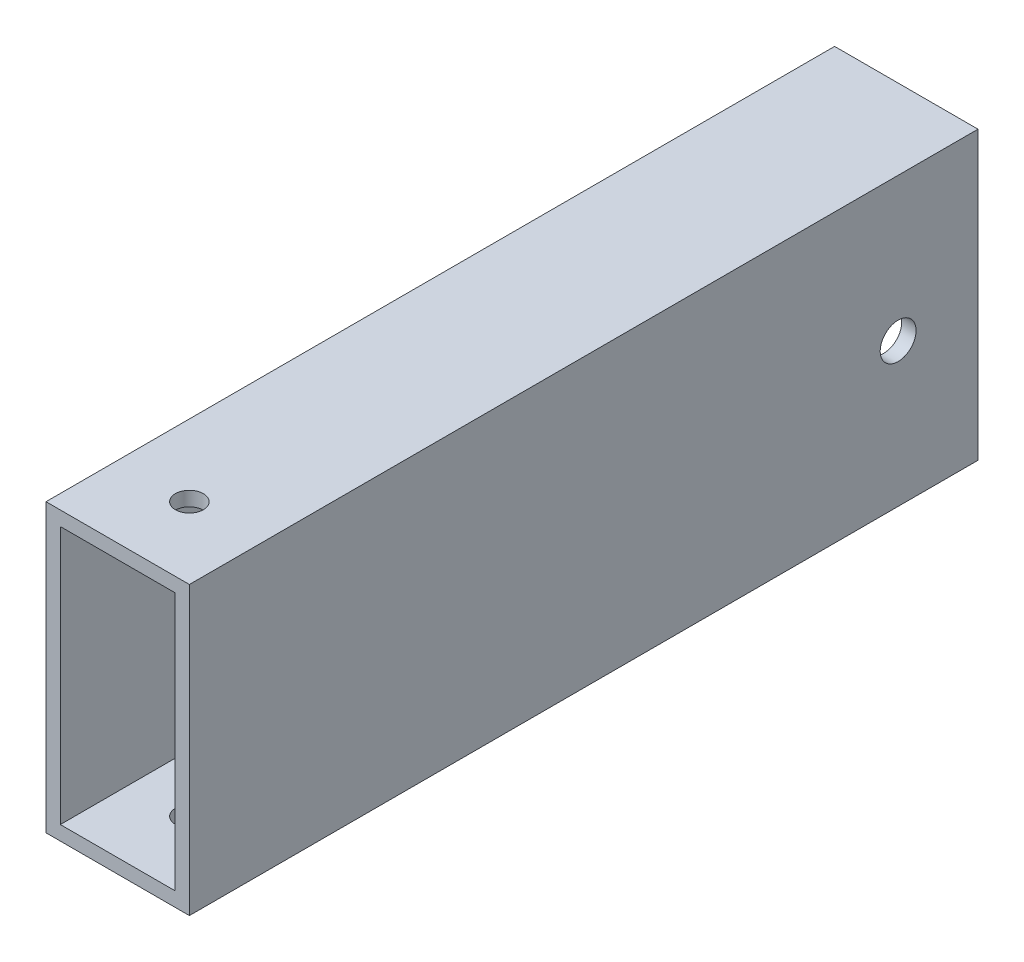
ISO-10303-21;
HEADER;
FILE_DESCRIPTION(('STEP AP214'),'2;1');
FILE_NAME('part.step','',(''),(''),'','','');
FILE_SCHEMA(('AUTOMOTIVE_DESIGN { 1 0 10303 214 1 1 1 1 }'));
ENDSEC;
DATA;
#1=APPLICATION_CONTEXT('core data for automotive mechanical design processes');
#2=APPLICATION_PROTOCOL_DEFINITION('international standard','automotive_design',2000,#1);
#3=PRODUCT_CONTEXT('',#1,'mechanical');
#4=PRODUCT('Part','Part','',(#3));
#5=PRODUCT_RELATED_PRODUCT_CATEGORY('part','',(#4));
#6=PRODUCT_DEFINITION_FORMATION('','',#4);
#7=PRODUCT_DEFINITION_CONTEXT('part definition',#1,'design');
#8=PRODUCT_DEFINITION('design','',#6,#7);
#9=PRODUCT_DEFINITION_SHAPE('','',#8);
#10=(LENGTH_UNIT() NAMED_UNIT(*) SI_UNIT(.MILLI.,.METRE.));
#11=(NAMED_UNIT(*) PLANE_ANGLE_UNIT() SI_UNIT($,.RADIAN.));
#12=(NAMED_UNIT(*) SI_UNIT($,.STERADIAN.) SOLID_ANGLE_UNIT());
#13=UNCERTAINTY_MEASURE_WITH_UNIT(LENGTH_MEASURE(1.E-05),#10,'distance_accuracy_value','');
#14=(GEOMETRIC_REPRESENTATION_CONTEXT(3) GLOBAL_UNCERTAINTY_ASSIGNED_CONTEXT((#13)) GLOBAL_UNIT_ASSIGNED_CONTEXT((#10,
#11,#12)) REPRESENTATION_CONTEXT('',''));
#15=CARTESIAN_POINT('',(0.,0.,0.));
#16=DIRECTION('',(0.,0.,1.));
#17=DIRECTION('',(1.,0.,0.));
#18=AXIS2_PLACEMENT_3D('',#15,#16,#17);
#19=CARTESIAN_POINT('',(0.,0.,69.85));
#20=DIRECTION('',(0.,0.,1.));
#21=DIRECTION('',(1.,0.,0.));
#22=AXIS2_PLACEMENT_3D('',#19,#20,#21);
#23=PLANE('',#22);
#24=DIRECTION('',(0.,1.,0.));
#25=VECTOR('',#24,1.);
#26=CARTESIAN_POINT('',(12.7,-25.4,69.85));
#27=LINE('',#26,#25);
#28=CARTESIAN_POINT('',(12.7,-25.4,69.85));
#29=VERTEX_POINT('',#28);
#30=CARTESIAN_POINT('',(12.7,25.4,69.85));
#31=VERTEX_POINT('',#30);
#32=EDGE_CURVE('E173',#29,#31,#27,.T.);
#33=ORIENTED_EDGE('',*,*,#32,.T.);
#34=DIRECTION('',(-1.,0.,0.));
#35=VECTOR('',#34,1.);
#36=CARTESIAN_POINT('',(-12.7,25.4,69.85));
#37=LINE('',#36,#35);
#38=CARTESIAN_POINT('',(-12.7,25.4,69.85));
#39=VERTEX_POINT('',#38);
#40=EDGE_CURVE('E176',#31,#39,#37,.T.);
#41=ORIENTED_EDGE('',*,*,#40,.T.);
#42=DIRECTION('',(0.,-1.,0.));
#43=VECTOR('',#42,1.);
#44=CARTESIAN_POINT('',(-12.7,-25.4,69.85));
#45=LINE('',#44,#43);
#46=CARTESIAN_POINT('',(-12.7,-25.4,69.85));
#47=VERTEX_POINT('',#46);
#48=EDGE_CURVE('E179',#39,#47,#45,.T.);
#49=ORIENTED_EDGE('',*,*,#48,.T.);
#50=DIRECTION('',(1.,0.,0.));
#51=VECTOR('',#50,1.);
#52=CARTESIAN_POINT('',(-12.7,-25.4,69.85));
#53=LINE('',#52,#51);
#54=EDGE_CURVE('E181',#47,#29,#53,.T.);
#55=ORIENTED_EDGE('',*,*,#54,.T.);
#56=EDGE_LOOP('',(#33,#41,#49,#55));
#57=FACE_BOUND('',#56,.T.);
#58=DIRECTION('',(-1.,0.,0.));
#59=VECTOR('',#58,1.);
#60=CARTESIAN_POINT('',(0.,22.86,69.85));
#61=LINE('',#60,#59);
#62=CARTESIAN_POINT('',(10.16,22.86,69.85));
#63=VERTEX_POINT('',#62);
#64=CARTESIAN_POINT('',(-10.16,22.86,69.85));
#65=VERTEX_POINT('',#64);
#66=EDGE_CURVE('E143',#63,#65,#61,.T.);
#67=ORIENTED_EDGE('',*,*,#66,.F.);
#68=DIRECTION('',(0.,1.,0.));
#69=VECTOR('',#68,1.);
#70=CARTESIAN_POINT('',(10.16,0.,69.85));
#71=LINE('',#70,#69);
#72=CARTESIAN_POINT('',(10.16,-22.86,69.85));
#73=VERTEX_POINT('',#72);
#74=EDGE_CURVE('E135',#73,#63,#71,.T.);
#75=ORIENTED_EDGE('',*,*,#74,.F.);
#76=DIRECTION('',(1.,0.,0.));
#77=VECTOR('',#76,1.);
#78=CARTESIAN_POINT('',(0.,-22.86,69.85));
#79=LINE('',#78,#77);
#80=CARTESIAN_POINT('',(-10.16,-22.86,69.85));
#81=VERTEX_POINT('',#80);
#82=EDGE_CURVE('E157',#81,#73,#79,.T.);
#83=ORIENTED_EDGE('',*,*,#82,.F.);
#84=DIRECTION('',(0.,-1.,0.));
#85=VECTOR('',#84,1.);
#86=CARTESIAN_POINT('',(-10.16,0.,69.85));
#87=LINE('',#86,#85);
#88=EDGE_CURVE('E155',#65,#81,#87,.T.);
#89=ORIENTED_EDGE('',*,*,#88,.F.);
#90=EDGE_LOOP('',(#67,#75,#83,#89));
#91=FACE_BOUND('',#90,.T.);
#92=ADVANCED_FACE('F68',(#57,#91),#23,.T.);
#93=CARTESIAN_POINT('',(0.,0.,-69.85));
#94=DIRECTION('',(0.,0.,1.));
#95=DIRECTION('',(1.,0.,0.));
#96=AXIS2_PLACEMENT_3D('',#93,#94,#95);
#97=PLANE('',#96);
#98=DIRECTION('',(0.,1.,0.));
#99=VECTOR('',#98,1.);
#100=CARTESIAN_POINT('',(12.7,-25.4,-69.85));
#101=LINE('',#100,#99);
#102=CARTESIAN_POINT('',(12.7,-25.4,-69.85));
#103=VERTEX_POINT('',#102);
#104=CARTESIAN_POINT('',(12.7,25.4,-69.85));
#105=VERTEX_POINT('',#104);
#106=EDGE_CURVE('E151',#103,#105,#101,.T.);
#107=ORIENTED_EDGE('',*,*,#106,.F.);
#108=DIRECTION('',(1.,0.,0.));
#109=VECTOR('',#108,1.);
#110=CARTESIAN_POINT('',(-12.7,-25.4,-69.85));
#111=LINE('',#110,#109);
#112=CARTESIAN_POINT('',(-12.7,-25.4,-69.85));
#113=VERTEX_POINT('',#112);
#114=EDGE_CURVE('E177',#113,#103,#111,.T.);
#115=ORIENTED_EDGE('',*,*,#114,.F.);
#116=DIRECTION('',(0.,-1.,0.));
#117=VECTOR('',#116,1.);
#118=CARTESIAN_POINT('',(-12.7,-25.4,-69.85));
#119=LINE('',#118,#117);
#120=CARTESIAN_POINT('',(-12.7,25.4,-69.85));
#121=VERTEX_POINT('',#120);
#122=EDGE_CURVE('E188',#121,#113,#119,.T.);
#123=ORIENTED_EDGE('',*,*,#122,.F.);
#124=DIRECTION('',(-1.,0.,0.));
#125=VECTOR('',#124,1.);
#126=CARTESIAN_POINT('',(-12.7,25.4,-69.85));
#127=LINE('',#126,#125);
#128=EDGE_CURVE('E186',#105,#121,#127,.T.);
#129=ORIENTED_EDGE('',*,*,#128,.F.);
#130=EDGE_LOOP('',(#107,#115,#123,#129));
#131=FACE_BOUND('',#130,.T.);
#132=DIRECTION('',(0.,1.,0.));
#133=VECTOR('',#132,1.);
#134=CARTESIAN_POINT('',(10.16,0.,-69.85));
#135=LINE('',#134,#133);
#136=CARTESIAN_POINT('',(10.16,-22.86,-69.85));
#137=VERTEX_POINT('',#136);
#138=CARTESIAN_POINT('',(10.16,22.86,-69.85));
#139=VERTEX_POINT('',#138);
#140=EDGE_CURVE('E93',#137,#139,#135,.T.);
#141=ORIENTED_EDGE('',*,*,#140,.T.);
#142=DIRECTION('',(-1.,0.,0.));
#143=VECTOR('',#142,1.);
#144=CARTESIAN_POINT('',(0.,22.86,-69.85));
#145=LINE('',#144,#143);
#146=CARTESIAN_POINT('',(-10.16,22.86,-69.85));
#147=VERTEX_POINT('',#146);
#148=EDGE_CURVE('E150',#139,#147,#145,.T.);
#149=ORIENTED_EDGE('',*,*,#148,.T.);
#150=DIRECTION('',(0.,-1.,0.));
#151=VECTOR('',#150,1.);
#152=CARTESIAN_POINT('',(-10.16,0.,-69.85));
#153=LINE('',#152,#151);
#154=CARTESIAN_POINT('',(-10.16,-22.86,-69.85));
#155=VERTEX_POINT('',#154);
#156=EDGE_CURVE('E165',#147,#155,#153,.T.);
#157=ORIENTED_EDGE('',*,*,#156,.T.);
#158=DIRECTION('',(1.,0.,0.));
#159=VECTOR('',#158,1.);
#160=CARTESIAN_POINT('',(0.,-22.86,-69.85));
#161=LINE('',#160,#159);
#162=EDGE_CURVE('E144',#155,#137,#161,.T.);
#163=ORIENTED_EDGE('',*,*,#162,.T.);
#164=EDGE_LOOP('',(#141,#149,#157,#163));
#165=FACE_BOUND('',#164,.T.);
#166=ADVANCED_FACE('F234',(#131,#165),#97,.F.);
#167=CARTESIAN_POINT('',(12.7,-25.4,69.85));
#168=DIRECTION('',(-1.,0.,0.));
#169=DIRECTION('',(0.,0.,1.));
#170=AXIS2_PLACEMENT_3D('',#167,#168,#169);
#171=PLANE('',#170);
#172=CARTESIAN_POINT('',(12.7,0.,-55.7022));
#173=DIRECTION('',(1.,0.,0.));
#174=DIRECTION('',(0.,0.,-1.));
#175=AXIS2_PLACEMENT_3D('',#172,#173,#174);
#176=CIRCLE('',#175,3.175);
#177=CARTESIAN_POINT('',(12.7,0.,-58.8772));
#178=VERTEX_POINT('',#177);
#179=EDGE_CURVE('E204',#178,#178,#176,.T.);
#180=ORIENTED_EDGE('',*,*,#179,.F.);
#181=EDGE_LOOP('',(#180));
#182=FACE_BOUND('',#181,.T.);
#183=ORIENTED_EDGE('',*,*,#106,.T.);
#184=DIRECTION('',(0.,0.,-1.));
#185=VECTOR('',#184,1.);
#186=CARTESIAN_POINT('',(12.7,25.4,69.85));
#187=LINE('',#186,#185);
#188=EDGE_CURVE('E14',#31,#105,#187,.T.);
#189=ORIENTED_EDGE('',*,*,#188,.F.);
#190=ORIENTED_EDGE('',*,*,#32,.F.);
#191=DIRECTION('',(0.,0.,-1.));
#192=VECTOR('',#191,1.);
#193=CARTESIAN_POINT('',(12.7,-25.4,69.85));
#194=LINE('',#193,#192);
#195=EDGE_CURVE('E183',#29,#103,#194,.T.);
#196=ORIENTED_EDGE('',*,*,#195,.T.);
#197=EDGE_LOOP('',(#183,#189,#190,#196));
#198=FACE_BOUND('',#197,.T.);
#199=ADVANCED_FACE('F70',(#182,#198),#171,.F.);
#200=CARTESIAN_POINT('',(-12.7,25.4,69.85));
#201=DIRECTION('',(0.,-1.,0.));
#202=DIRECTION('',(0.,0.,-1.));
#203=AXIS2_PLACEMENT_3D('',#200,#201,#202);
#204=PLANE('',#203);
#205=CARTESIAN_POINT('',(0.,25.4,57.1499999999953));
#206=DIRECTION('',(0.,1.,0.));
#207=DIRECTION('',(0.,0.,1.));
#208=AXIS2_PLACEMENT_3D('',#205,#206,#207);
#209=CIRCLE('',#208,2.4765);
#210=CARTESIAN_POINT('',(0.,25.4,59.6264999999953));
#211=VERTEX_POINT('',#210);
#212=EDGE_CURVE('E214',#211,#211,#209,.T.);
#213=ORIENTED_EDGE('',*,*,#212,.F.);
#214=EDGE_LOOP('',(#213));
#215=FACE_BOUND('',#214,.T.);
#216=ORIENTED_EDGE('',*,*,#128,.T.);
#217=DIRECTION('',(0.,0.,-1.));
#218=VECTOR('',#217,1.);
#219=CARTESIAN_POINT('',(-12.7,25.4,69.85));
#220=LINE('',#219,#218);
#221=EDGE_CURVE('E77',#39,#121,#220,.T.);
#222=ORIENTED_EDGE('',*,*,#221,.F.);
#223=ORIENTED_EDGE('',*,*,#40,.F.);
#224=ORIENTED_EDGE('',*,*,#188,.T.);
#225=EDGE_LOOP('',(#216,#222,#223,#224));
#226=FACE_BOUND('',#225,.T.);
#227=ADVANCED_FACE('F261',(#215,#226),#204,.F.);
#228=CARTESIAN_POINT('',(-12.7,-25.4,69.85));
#229=DIRECTION('',(1.,0.,0.));
#230=DIRECTION('',(0.,0.,-1.));
#231=AXIS2_PLACEMENT_3D('',#228,#229,#230);
#232=PLANE('',#231);
#233=CARTESIAN_POINT('',(-12.7,0.,-55.7022));
#234=DIRECTION('',(1.,0.,0.));
#235=DIRECTION('',(0.,0.,-1.));
#236=AXIS2_PLACEMENT_3D('',#233,#234,#235);
#237=CIRCLE('',#236,3.175);
#238=CARTESIAN_POINT('',(-12.7,0.,-58.8772));
#239=VERTEX_POINT('',#238);
#240=EDGE_CURVE('E199',#239,#239,#237,.T.);
#241=ORIENTED_EDGE('',*,*,#240,.T.);
#242=EDGE_LOOP('',(#241));
#243=FACE_BOUND('',#242,.T.);
#244=ORIENTED_EDGE('',*,*,#122,.T.);
#245=DIRECTION('',(0.,0.,-1.));
#246=VECTOR('',#245,1.);
#247=CARTESIAN_POINT('',(-12.7,-25.4,69.85));
#248=LINE('',#247,#246);
#249=EDGE_CURVE('E193',#47,#113,#248,.T.);
#250=ORIENTED_EDGE('',*,*,#249,.F.);
#251=ORIENTED_EDGE('',*,*,#48,.F.);
#252=ORIENTED_EDGE('',*,*,#221,.T.);
#253=EDGE_LOOP('',(#244,#250,#251,#252));
#254=FACE_BOUND('',#253,.T.);
#255=ADVANCED_FACE('F259',(#243,#254),#232,.F.);
#256=CARTESIAN_POINT('',(-12.7,-25.4,69.85));
#257=DIRECTION('',(0.,1.,0.));
#258=DIRECTION('',(0.,0.,1.));
#259=AXIS2_PLACEMENT_3D('',#256,#257,#258);
#260=PLANE('',#259);
#261=CARTESIAN_POINT('',(0.,-25.4,57.1499999999953));
#262=DIRECTION('',(0.,1.,0.));
#263=DIRECTION('',(0.,0.,1.));
#264=AXIS2_PLACEMENT_3D('',#261,#262,#263);
#265=CIRCLE('',#264,2.4765);
#266=CARTESIAN_POINT('',(0.,-25.4,59.6264999999953));
#267=VERTEX_POINT('',#266);
#268=EDGE_CURVE('E217',#267,#267,#265,.T.);
#269=ORIENTED_EDGE('',*,*,#268,.T.);
#270=EDGE_LOOP('',(#269));
#271=FACE_BOUND('',#270,.T.);
#272=ORIENTED_EDGE('',*,*,#114,.T.);
#273=ORIENTED_EDGE('',*,*,#195,.F.);
#274=ORIENTED_EDGE('',*,*,#54,.F.);
#275=ORIENTED_EDGE('',*,*,#249,.T.);
#276=EDGE_LOOP('',(#272,#273,#274,#275));
#277=FACE_BOUND('',#276,.T.);
#278=ADVANCED_FACE('F256',(#271,#277),#260,.F.);
#279=CARTESIAN_POINT('',(10.16,0.,69.85));
#280=DIRECTION('',(-1.,0.,0.));
#281=DIRECTION('',(0.,0.,1.));
#282=AXIS2_PLACEMENT_3D('',#279,#280,#281);
#283=PLANE('',#282);
#284=CARTESIAN_POINT('',(10.16,0.,-55.7022));
#285=DIRECTION('',(-1.,0.,0.));
#286=DIRECTION('',(0.,0.,1.));
#287=AXIS2_PLACEMENT_3D('',#284,#285,#286);
#288=CIRCLE('',#287,3.175);
#289=CARTESIAN_POINT('',(10.16,0.,-52.5272));
#290=VERTEX_POINT('',#289);
#291=EDGE_CURVE('E163',#290,#290,#288,.T.);
#292=ORIENTED_EDGE('',*,*,#291,.F.);
#293=EDGE_LOOP('',(#292));
#294=FACE_BOUND('',#293,.T.);
#295=ORIENTED_EDGE('',*,*,#140,.F.);
#296=DIRECTION('',(0.,0.,-1.));
#297=VECTOR('',#296,1.);
#298=CARTESIAN_POINT('',(10.16,-22.86,69.85));
#299=LINE('',#298,#297);
#300=EDGE_CURVE('E139',#73,#137,#299,.T.);
#301=ORIENTED_EDGE('',*,*,#300,.F.);
#302=ORIENTED_EDGE('',*,*,#74,.T.);
#303=DIRECTION('',(0.,0.,-1.));
#304=VECTOR('',#303,1.);
#305=CARTESIAN_POINT('',(10.16,22.86,69.85));
#306=LINE('',#305,#304);
#307=EDGE_CURVE('E138',#63,#139,#306,.T.);
#308=ORIENTED_EDGE('',*,*,#307,.T.);
#309=EDGE_LOOP('',(#295,#301,#302,#308));
#310=FACE_BOUND('',#309,.T.);
#311=ADVANCED_FACE('F137',(#294,#310),#283,.T.);
#312=CARTESIAN_POINT('',(0.,22.86,69.85));
#313=DIRECTION('',(0.,-1.,0.));
#314=DIRECTION('',(0.,0.,-1.));
#315=AXIS2_PLACEMENT_3D('',#312,#313,#314);
#316=PLANE('',#315);
#317=CARTESIAN_POINT('',(0.,22.86,57.1499999999953));
#318=DIRECTION('',(0.,-1.,0.));
#319=DIRECTION('',(0.,0.,-1.));
#320=AXIS2_PLACEMENT_3D('',#317,#318,#319);
#321=CIRCLE('',#320,2.4765);
#322=CARTESIAN_POINT('',(0.,22.86,54.6734999999953));
#323=VERTEX_POINT('',#322);
#324=EDGE_CURVE('E209',#323,#323,#321,.T.);
#325=ORIENTED_EDGE('',*,*,#324,.F.);
#326=EDGE_LOOP('',(#325));
#327=FACE_BOUND('',#326,.T.);
#328=ORIENTED_EDGE('',*,*,#148,.F.);
#329=ORIENTED_EDGE('',*,*,#307,.F.);
#330=ORIENTED_EDGE('',*,*,#66,.T.);
#331=DIRECTION('',(0.,0.,-1.));
#332=VECTOR('',#331,1.);
#333=CARTESIAN_POINT('',(-10.16,22.86,69.85));
#334=LINE('',#333,#332);
#335=EDGE_CURVE('E152',#65,#147,#334,.T.);
#336=ORIENTED_EDGE('',*,*,#335,.T.);
#337=EDGE_LOOP('',(#328,#329,#330,#336));
#338=FACE_BOUND('',#337,.T.);
#339=ADVANCED_FACE('F147',(#327,#338),#316,.T.);
#340=CARTESIAN_POINT('',(-10.16,0.,69.85));
#341=DIRECTION('',(1.,0.,0.));
#342=DIRECTION('',(0.,0.,-1.));
#343=AXIS2_PLACEMENT_3D('',#340,#341,#342);
#344=PLANE('',#343);
#345=CARTESIAN_POINT('',(-10.16,0.,-55.7022));
#346=DIRECTION('',(1.,0.,0.));
#347=DIRECTION('',(0.,0.,-1.));
#348=AXIS2_PLACEMENT_3D('',#345,#346,#347);
#349=CIRCLE('',#348,3.175);
#350=CARTESIAN_POINT('',(-10.16,0.,-58.8772));
#351=VERTEX_POINT('',#350);
#352=EDGE_CURVE('E197',#351,#351,#349,.T.);
#353=ORIENTED_EDGE('',*,*,#352,.F.);
#354=EDGE_LOOP('',(#353));
#355=FACE_BOUND('',#354,.T.);
#356=ORIENTED_EDGE('',*,*,#156,.F.);
#357=ORIENTED_EDGE('',*,*,#335,.F.);
#358=ORIENTED_EDGE('',*,*,#88,.T.);
#359=DIRECTION('',(0.,0.,-1.));
#360=VECTOR('',#359,1.);
#361=CARTESIAN_POINT('',(-10.16,-22.86,69.85));
#362=LINE('',#361,#360);
#363=EDGE_CURVE('E85',#81,#155,#362,.T.);
#364=ORIENTED_EDGE('',*,*,#363,.T.);
#365=EDGE_LOOP('',(#356,#357,#358,#364));
#366=FACE_BOUND('',#365,.T.);
#367=ADVANCED_FACE('F230',(#355,#366),#344,.T.);
#368=CARTESIAN_POINT('',(0.,-22.86,69.85));
#369=DIRECTION('',(0.,1.,0.));
#370=DIRECTION('',(0.,0.,1.));
#371=AXIS2_PLACEMENT_3D('',#368,#369,#370);
#372=PLANE('',#371);
#373=CARTESIAN_POINT('',(0.,-22.86,57.1499999999953));
#374=DIRECTION('',(0.,1.,0.));
#375=DIRECTION('',(0.,0.,1.));
#376=AXIS2_PLACEMENT_3D('',#373,#374,#375);
#377=CIRCLE('',#376,2.4765);
#378=CARTESIAN_POINT('',(0.,-22.86,59.6264999999953));
#379=VERTEX_POINT('',#378);
#380=EDGE_CURVE('E72',#379,#379,#377,.T.);
#381=ORIENTED_EDGE('',*,*,#380,.F.);
#382=EDGE_LOOP('',(#381));
#383=FACE_BOUND('',#382,.T.);
#384=ORIENTED_EDGE('',*,*,#162,.F.);
#385=ORIENTED_EDGE('',*,*,#363,.F.);
#386=ORIENTED_EDGE('',*,*,#82,.T.);
#387=ORIENTED_EDGE('',*,*,#300,.T.);
#388=EDGE_LOOP('',(#384,#385,#386,#387));
#389=FACE_BOUND('',#388,.T.);
#390=ADVANCED_FACE('F227',(#383,#389),#372,.T.);
#391=CARTESIAN_POINT('',(-12.7,0.,-55.7022));
#392=DIRECTION('',(1.,0.,0.));
#393=DIRECTION('',(0.,0.,-1.));
#394=AXIS2_PLACEMENT_3D('',#391,#392,#393);
#395=CYLINDRICAL_SURFACE('',#394,3.175);
#396=ORIENTED_EDGE('',*,*,#352,.T.);
#397=EDGE_LOOP('',(#396));
#398=FACE_BOUND('',#397,.T.);
#399=ORIENTED_EDGE('',*,*,#240,.F.);
#400=EDGE_LOOP('',(#399));
#401=FACE_BOUND('',#400,.T.);
#402=ADVANCED_FACE('F229',(#398,#401),#395,.F.);
#403=ORIENTED_EDGE('',*,*,#291,.T.);
#404=EDGE_LOOP('',(#403));
#405=FACE_BOUND('',#404,.T.);
#406=ORIENTED_EDGE('',*,*,#179,.T.);
#407=EDGE_LOOP('',(#406));
#408=FACE_BOUND('',#407,.T.);
#409=ADVANCED_FACE('F292',(#405,#408),#395,.F.);
#410=CARTESIAN_POINT('',(0.,-25.4,57.1499999999953));
#411=DIRECTION('',(0.,1.,0.));
#412=DIRECTION('',(0.,0.,1.));
#413=AXIS2_PLACEMENT_3D('',#410,#411,#412);
#414=CYLINDRICAL_SURFACE('',#413,2.4765);
#415=ORIENTED_EDGE('',*,*,#380,.T.);
#416=EDGE_LOOP('',(#415));
#417=FACE_BOUND('',#416,.T.);
#418=ORIENTED_EDGE('',*,*,#268,.F.);
#419=EDGE_LOOP('',(#418));
#420=FACE_BOUND('',#419,.T.);
#421=ADVANCED_FACE('F224',(#417,#420),#414,.F.);
#422=ORIENTED_EDGE('',*,*,#324,.T.);
#423=EDGE_LOOP('',(#422));
#424=FACE_BOUND('',#423,.T.);
#425=ORIENTED_EDGE('',*,*,#212,.T.);
#426=EDGE_LOOP('',(#425));
#427=FACE_BOUND('',#426,.T.);
#428=ADVANCED_FACE('F285',(#424,#427),#414,.F.);
#429=CLOSED_SHELL('',(#92,#166,#199,#227,#255,#278,#311,#339,#367,#390,#402,#409,#421,#428));
#430=MANIFOLD_SOLID_BREP('B2',#429);
#431=ADVANCED_BREP_SHAPE_REPRESENTATION('',(#18,#430),#14);
#432=SHAPE_DEFINITION_REPRESENTATION(#9,#431);
ENDSEC;
END-ISO-10303-21;
